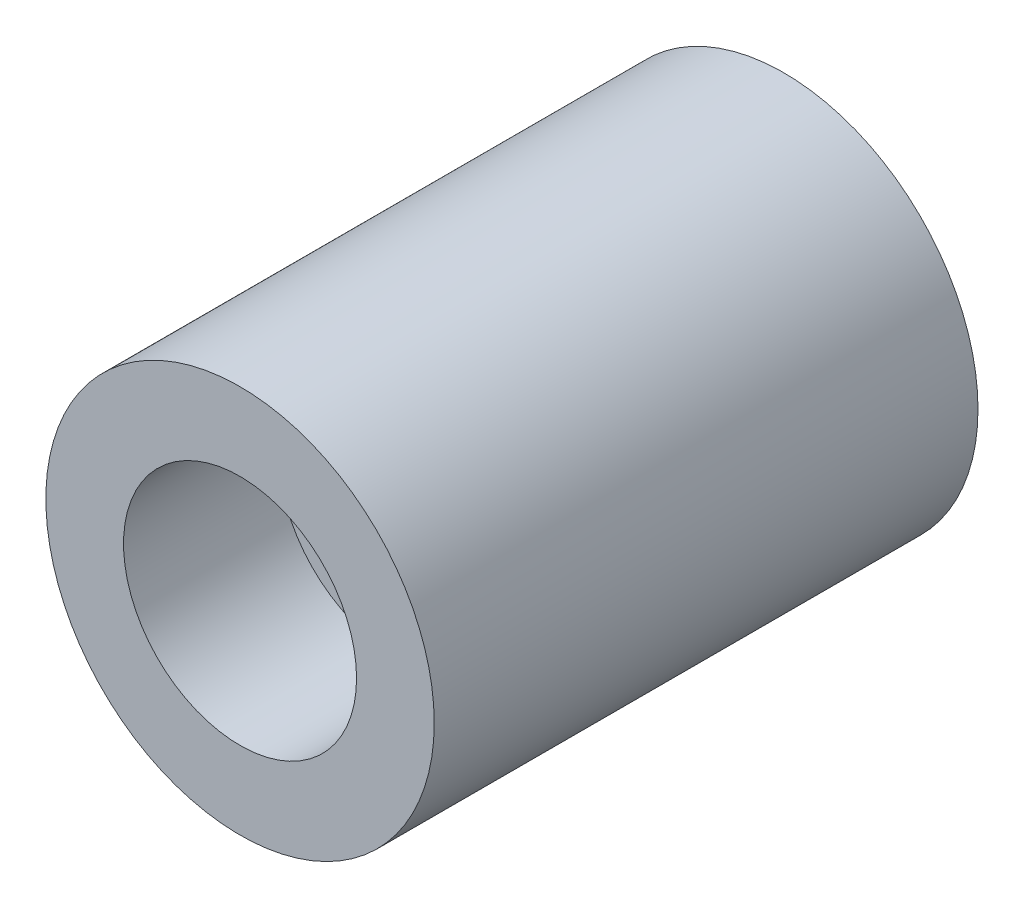
ISO-10303-21;
HEADER;
FILE_DESCRIPTION(('STEP AP214'),'2;1');
FILE_NAME('part.step','',(''),(''),'','','');
FILE_SCHEMA(('AUTOMOTIVE_DESIGN { 1 0 10303 214 1 1 1 1 }'));
ENDSEC;
DATA;
#1=APPLICATION_CONTEXT('core data for automotive mechanical design processes');
#2=APPLICATION_PROTOCOL_DEFINITION('international standard','automotive_design',2000,#1);
#3=PRODUCT_CONTEXT('',#1,'mechanical');
#4=PRODUCT('Part','Part','',(#3));
#5=PRODUCT_RELATED_PRODUCT_CATEGORY('part','',(#4));
#6=PRODUCT_DEFINITION_FORMATION('','',#4);
#7=PRODUCT_DEFINITION_CONTEXT('part definition',#1,'design');
#8=PRODUCT_DEFINITION('design','',#6,#7);
#9=PRODUCT_DEFINITION_SHAPE('','',#8);
#10=(LENGTH_UNIT() NAMED_UNIT(*) SI_UNIT(.MILLI.,.METRE.));
#11=(NAMED_UNIT(*) PLANE_ANGLE_UNIT() SI_UNIT($,.RADIAN.));
#12=(NAMED_UNIT(*) SI_UNIT($,.STERADIAN.) SOLID_ANGLE_UNIT());
#13=UNCERTAINTY_MEASURE_WITH_UNIT(LENGTH_MEASURE(1.E-05),#10,'distance_accuracy_value','');
#14=(GEOMETRIC_REPRESENTATION_CONTEXT(3) GLOBAL_UNCERTAINTY_ASSIGNED_CONTEXT((#13)) GLOBAL_UNIT_ASSIGNED_CONTEXT((#10,
#11,#12)) REPRESENTATION_CONTEXT('',''));
#15=CARTESIAN_POINT('',(0.,0.,0.));
#16=DIRECTION('',(0.,0.,1.));
#17=DIRECTION('',(1.,0.,0.));
#18=AXIS2_PLACEMENT_3D('',#15,#16,#17);
#19=CARTESIAN_POINT('',(0.,0.,3556.));
#20=DIRECTION('',(0.,0.,-1.));
#21=DIRECTION('',(-1.,0.,0.));
#22=AXIS2_PLACEMENT_3D('',#19,#20,#21);
#23=CYLINDRICAL_SURFACE('',#22,1270.);
#24=CARTESIAN_POINT('',(0.,0.,3556.));
#25=DIRECTION('',(0.,0.,1.));
#26=DIRECTION('',(1.,0.,0.));
#27=AXIS2_PLACEMENT_3D('',#24,#25,#26);
#28=CIRCLE('',#27,1270.);
#29=CARTESIAN_POINT('',(1270.,0.,3556.));
#30=VERTEX_POINT('',#29);
#31=EDGE_CURVE('E10',#30,#30,#28,.T.);
#32=ORIENTED_EDGE('',*,*,#31,.F.);
#33=EDGE_LOOP('',(#32));
#34=FACE_BOUND('',#33,.T.);
#35=CARTESIAN_POINT('',(0.,0.,0.));
#36=DIRECTION('',(0.,0.,1.));
#37=DIRECTION('',(1.,0.,0.));
#38=AXIS2_PLACEMENT_3D('',#35,#36,#37);
#39=CIRCLE('',#38,1270.);
#40=CARTESIAN_POINT('',(1270.,0.,0.));
#41=VERTEX_POINT('',#40);
#42=EDGE_CURVE('E38',#41,#41,#39,.T.);
#43=ORIENTED_EDGE('',*,*,#42,.T.);
#44=EDGE_LOOP('',(#43));
#45=FACE_BOUND('',#44,.T.);
#46=ADVANCED_FACE('F31',(#34,#45),#23,.T.);
#47=CARTESIAN_POINT('',(0.,0.,3556.));
#48=DIRECTION('',(0.,0.,1.));
#49=DIRECTION('',(1.,0.,0.));
#50=AXIS2_PLACEMENT_3D('',#47,#48,#49);
#51=PLANE('',#50);
#52=CARTESIAN_POINT('',(0.,0.,3556.));
#53=DIRECTION('',(0.,0.,1.));
#54=DIRECTION('',(1.,0.,0.));
#55=AXIS2_PLACEMENT_3D('',#52,#53,#54);
#56=CIRCLE('',#55,762.);
#57=CARTESIAN_POINT('',(762.,0.,3556.));
#58=VERTEX_POINT('',#57);
#59=EDGE_CURVE('E45',#58,#58,#56,.T.);
#60=ORIENTED_EDGE('',*,*,#59,.F.);
#61=EDGE_LOOP('',(#60));
#62=FACE_BOUND('',#61,.T.);
#63=ORIENTED_EDGE('',*,*,#31,.T.);
#64=EDGE_LOOP('',(#63));
#65=FACE_BOUND('',#64,.T.);
#66=ADVANCED_FACE('F73',(#62,#65),#51,.T.);
#67=CARTESIAN_POINT('',(0.,0.,0.));
#68=DIRECTION('',(0.,0.,1.));
#69=DIRECTION('',(1.,0.,0.));
#70=AXIS2_PLACEMENT_3D('',#67,#68,#69);
#71=PLANE('',#70);
#72=ORIENTED_EDGE('',*,*,#42,.F.);
#73=EDGE_LOOP('',(#72));
#74=FACE_BOUND('',#73,.T.);
#75=ADVANCED_FACE('F69',(#74),#71,.F.);
#76=CARTESIAN_POINT('',(0.,0.,2540.));
#77=DIRECTION('',(0.,0.,1.));
#78=DIRECTION('',(1.,0.,0.));
#79=AXIS2_PLACEMENT_3D('',#76,#77,#78);
#80=CYLINDRICAL_SURFACE('',#79,762.);
#81=CARTESIAN_POINT('',(0.,0.,2540.));
#82=DIRECTION('',(0.,0.,1.));
#83=DIRECTION('',(1.,0.,0.));
#84=AXIS2_PLACEMENT_3D('',#81,#82,#83);
#85=CIRCLE('',#84,762.);
#86=CARTESIAN_POINT('',(762.,0.,2540.));
#87=VERTEX_POINT('',#86);
#88=EDGE_CURVE('E43',#87,#87,#85,.T.);
#89=ORIENTED_EDGE('',*,*,#88,.F.);
#90=EDGE_LOOP('',(#89));
#91=FACE_BOUND('',#90,.T.);
#92=ORIENTED_EDGE('',*,*,#59,.T.);
#93=EDGE_LOOP('',(#92));
#94=FACE_BOUND('',#93,.T.);
#95=ADVANCED_FACE('F63',(#91,#94),#80,.F.);
#96=CARTESIAN_POINT('',(0.,0.,2540.));
#97=DIRECTION('',(0.,0.,1.));
#98=DIRECTION('',(1.,0.,0.));
#99=AXIS2_PLACEMENT_3D('',#96,#97,#98);
#100=PLANE('',#99);
#101=CARTESIAN_POINT('',(0.,0.,2540.));
#102=DIRECTION('',(0.,0.,1.));
#103=DIRECTION('',(1.,0.,0.));
#104=AXIS2_PLACEMENT_3D('',#101,#102,#103);
#105=CIRCLE('',#104,254.);
#106=CARTESIAN_POINT('',(254.,0.,2540.));
#107=VERTEX_POINT('',#106);
#108=EDGE_CURVE('E34',#107,#107,#105,.T.);
#109=ORIENTED_EDGE('',*,*,#108,.F.);
#110=EDGE_LOOP('',(#109));
#111=FACE_BOUND('',#110,.T.);
#112=ORIENTED_EDGE('',*,*,#88,.T.);
#113=EDGE_LOOP('',(#112));
#114=FACE_BOUND('',#113,.T.);
#115=ADVANCED_FACE('F60',(#111,#114),#100,.T.);
#116=CARTESIAN_POINT('',(0.,0.,508.));
#117=DIRECTION('',(0.,0.,1.));
#118=DIRECTION('',(1.,0.,0.));
#119=AXIS2_PLACEMENT_3D('',#116,#117,#118);
#120=CYLINDRICAL_SURFACE('',#119,254.);
#121=ORIENTED_EDGE('',*,*,#108,.T.);
#122=EDGE_LOOP('',(#121));
#123=FACE_BOUND('',#122,.T.);
#124=CARTESIAN_POINT('',(0.,0.,508.));
#125=DIRECTION('',(0.,0.,1.));
#126=DIRECTION('',(1.,0.,0.));
#127=AXIS2_PLACEMENT_3D('',#124,#125,#126);
#128=CIRCLE('',#127,254.);
#129=CARTESIAN_POINT('',(254.,0.,508.));
#130=VERTEX_POINT('',#129);
#131=EDGE_CURVE('E50',#130,#130,#128,.T.);
#132=ORIENTED_EDGE('',*,*,#131,.F.);
#133=EDGE_LOOP('',(#132));
#134=FACE_BOUND('',#133,.T.);
#135=ADVANCED_FACE('F57',(#123,#134),#120,.F.);
#136=CARTESIAN_POINT('',(0.,0.,508.));
#137=DIRECTION('',(0.,0.,1.));
#138=DIRECTION('',(1.,0.,0.));
#139=AXIS2_PLACEMENT_3D('',#136,#137,#138);
#140=PLANE('',#139);
#141=ORIENTED_EDGE('',*,*,#131,.T.);
#142=EDGE_LOOP('',(#141));
#143=FACE_BOUND('',#142,.T.);
#144=ADVANCED_FACE('F85',(#143),#140,.T.);
#145=CLOSED_SHELL('',(#46,#66,#75,#95,#115,#135,#144));
#146=MANIFOLD_SOLID_BREP('B2',#145);
#147=ADVANCED_BREP_SHAPE_REPRESENTATION('',(#18,#146),#14);
#148=SHAPE_DEFINITION_REPRESENTATION(#9,#147);
ENDSEC;
END-ISO-10303-21;
